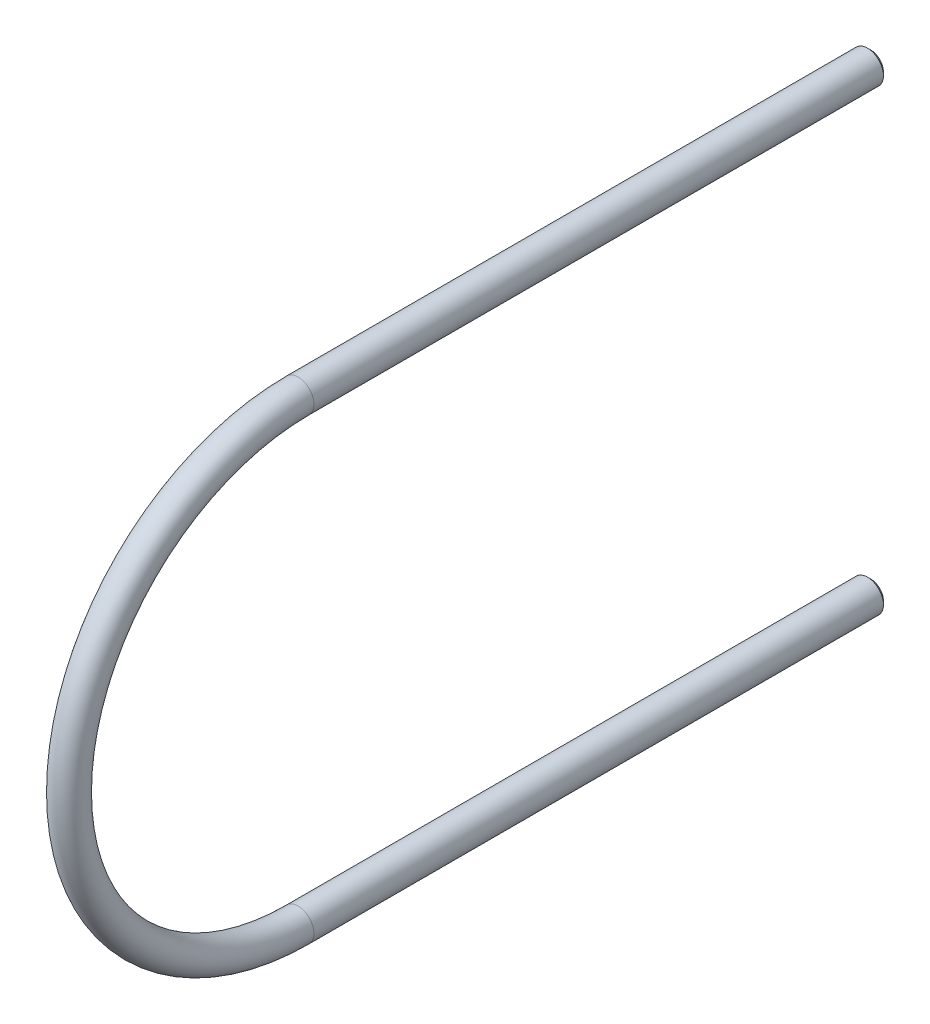
ISO-10303-21;
HEADER;
FILE_DESCRIPTION(('STEP AP214'),'2;1');
FILE_NAME('part.step','',(''),(''),'','','');
FILE_SCHEMA(('AUTOMOTIVE_DESIGN { 1 0 10303 214 1 1 1 1 }'));
ENDSEC;
DATA;
#1=APPLICATION_CONTEXT('core data for automotive mechanical design processes');
#2=APPLICATION_PROTOCOL_DEFINITION('international standard','automotive_design',2000,#1);
#3=PRODUCT_CONTEXT('',#1,'mechanical');
#4=PRODUCT('Part','Part','',(#3));
#5=PRODUCT_RELATED_PRODUCT_CATEGORY('part','',(#4));
#6=PRODUCT_DEFINITION_FORMATION('','',#4);
#7=PRODUCT_DEFINITION_CONTEXT('part definition',#1,'design');
#8=PRODUCT_DEFINITION('design','',#6,#7);
#9=PRODUCT_DEFINITION_SHAPE('','',#8);
#10=(LENGTH_UNIT() NAMED_UNIT(*) SI_UNIT(.MILLI.,.METRE.));
#11=(NAMED_UNIT(*) PLANE_ANGLE_UNIT() SI_UNIT($,.RADIAN.));
#12=(NAMED_UNIT(*) SI_UNIT($,.STERADIAN.) SOLID_ANGLE_UNIT());
#13=UNCERTAINTY_MEASURE_WITH_UNIT(LENGTH_MEASURE(1.E-05),#10,'distance_accuracy_value','');
#14=(GEOMETRIC_REPRESENTATION_CONTEXT(3) GLOBAL_UNCERTAINTY_ASSIGNED_CONTEXT((#13)) GLOBAL_UNIT_ASSIGNED_CONTEXT((#10,
#11,#12)) REPRESENTATION_CONTEXT('',''));
#15=CARTESIAN_POINT('',(0.,0.,0.));
#16=DIRECTION('',(0.,0.,1.));
#17=DIRECTION('',(1.,0.,0.));
#18=AXIS2_PLACEMENT_3D('',#15,#16,#17);
#19=CARTESIAN_POINT('',(0.,0.,0.));
#20=DIRECTION('',(-1.,0.,0.));
#21=DIRECTION('',(0.,0.,1.));
#22=AXIS2_PLACEMENT_3D('',#19,#20,#21);
#23=TOROIDAL_SURFACE('',#22,36.,2.5);
#24=CARTESIAN_POINT('',(0.,-36.,-2.51386656396706E-13));
#25=DIRECTION('',(0.,0.,-1.));
#26=DIRECTION('',(1.,0.,0.));
#27=AXIS2_PLACEMENT_3D('',#24,#25,#26);
#28=CIRCLE('',#27,2.5);
#29=CARTESIAN_POINT('',(0.,-38.5,-2.68844063090921E-13));
#30=VERTEX_POINT('',#29);
#31=EDGE_CURVE('E54',#30,#30,#28,.T.);
#32=CARTESIAN_POINT('',(0.,36.,0.));
#33=DIRECTION('',(0.,0.,1.));
#34=DIRECTION('',(1.,0.,0.));
#35=AXIS2_PLACEMENT_3D('',#32,#33,#34);
#36=CIRCLE('',#35,2.5);
#37=CARTESIAN_POINT('',(0.,38.5,0.));
#38=VERTEX_POINT('',#37);
#39=EDGE_CURVE('E57',#38,#38,#36,.T.);
#40=CARTESIAN_POINT('',(0.,0.,0.));
#41=DIRECTION('',(-1.,0.,0.));
#42=DIRECTION('',(0.,0.,1.));
#43=AXIS2_PLACEMENT_3D('',#40,#41,#42);
#44=CIRCLE('',#43,38.5);
#45=EDGE_CURVE('',#30,#38,#44,.T.);
#46=ORIENTED_EDGE('',*,*,#31,.F.);
#47=ORIENTED_EDGE('',*,*,#39,.T.);
#48=ORIENTED_EDGE('',*,*,#45,.T.);
#49=ORIENTED_EDGE('',*,*,#45,.F.);
#50=EDGE_LOOP('',(#46,#48,#47,#49));
#51=FACE_BOUND('',#50,.T.);
#52=ADVANCED_FACE('F33',(#51),#23,.T.);
#53=CARTESIAN_POINT('',(0.,36.,-90.));
#54=DIRECTION('',(0.,0.,1.));
#55=DIRECTION('',(1.,0.,0.));
#56=AXIS2_PLACEMENT_3D('',#53,#54,#55);
#57=CYLINDRICAL_SURFACE('',#56,2.5);
#58=CARTESIAN_POINT('',(0.,36.,-89.4999999999999));
#59=DIRECTION('',(0.,0.,1.));
#60=DIRECTION('',(1.,0.,0.));
#61=AXIS2_PLACEMENT_3D('',#58,#59,#60);
#62=CIRCLE('',#61,2.5);
#63=CARTESIAN_POINT('',(2.5,36.,-89.4999999999999));
#64=VERTEX_POINT('',#63);
#65=EDGE_CURVE('E41',#64,#64,#62,.T.);
#66=ORIENTED_EDGE('',*,*,#65,.T.);
#67=EDGE_LOOP('',(#66));
#68=FACE_BOUND('',#67,.T.);
#69=ORIENTED_EDGE('',*,*,#39,.F.);
#70=EDGE_LOOP('',(#69));
#71=FACE_BOUND('',#70,.T.);
#72=ADVANCED_FACE('F62',(#68,#71),#57,.T.);
#73=CARTESIAN_POINT('',(0.,36.,-90.));
#74=DIRECTION('',(0.,0.,1.));
#75=DIRECTION('',(1.,0.,0.));
#76=AXIS2_PLACEMENT_3D('',#73,#74,#75);
#77=PLANE('',#76);
#78=CARTESIAN_POINT('',(0.,36.,-90.));
#79=DIRECTION('',(0.,0.,1.));
#80=DIRECTION('',(1.,0.,0.));
#81=AXIS2_PLACEMENT_3D('',#78,#79,#80);
#82=CIRCLE('',#81,1.99999999999992);
#83=CARTESIAN_POINT('',(1.99999999999992,36.,-90.));
#84=VERTEX_POINT('',#83);
#85=EDGE_CURVE('E10',#84,#84,#82,.F.);
#86=ORIENTED_EDGE('',*,*,#85,.T.);
#87=EDGE_LOOP('',(#86));
#88=FACE_BOUND('',#87,.T.);
#89=ADVANCED_FACE('F64',(#88),#77,.F.);
#90=CARTESIAN_POINT('',(0.,-35.9999999999994,-90.0000000000002));
#91=DIRECTION('',(0.,0.,1.));
#92=DIRECTION('',(0.,-1.,0.));
#93=AXIS2_PLACEMENT_3D('',#90,#91,#92);
#94=CYLINDRICAL_SURFACE('',#93,2.5);
#95=CARTESIAN_POINT('',(0.,-35.9999999999994,-89.5000000000003));
#96=DIRECTION('',(0.,0.,-1.));
#97=DIRECTION('',(0.,1.,0.));
#98=AXIS2_PLACEMENT_3D('',#95,#96,#97);
#99=CIRCLE('',#98,2.5);
#100=CARTESIAN_POINT('',(0.,-33.4999999999994,-89.5000000000002));
#101=VERTEX_POINT('',#100);
#102=EDGE_CURVE('E45',#101,#101,#99,.F.);
#103=ORIENTED_EDGE('',*,*,#102,.T.);
#104=EDGE_LOOP('',(#103));
#105=FACE_BOUND('',#104,.T.);
#106=ORIENTED_EDGE('',*,*,#31,.T.);
#107=EDGE_LOOP('',(#106));
#108=FACE_BOUND('',#107,.T.);
#109=ADVANCED_FACE('F70',(#105,#108),#94,.T.);
#110=CARTESIAN_POINT('',(0.,-35.9999999999994,-90.0000000000002));
#111=DIRECTION('',(0.,0.,-1.));
#112=DIRECTION('',(0.,1.,0.));
#113=AXIS2_PLACEMENT_3D('',#110,#111,#112);
#114=PLANE('',#113);
#115=CARTESIAN_POINT('',(0.,-35.9999999999994,-90.0000000000002));
#116=DIRECTION('',(0.,0.,-1.));
#117=DIRECTION('',(0.,1.,0.));
#118=AXIS2_PLACEMENT_3D('',#115,#116,#117);
#119=CIRCLE('',#118,2.00000000000002);
#120=CARTESIAN_POINT('',(0.,-33.9999999999993,-90.0000000000002));
#121=VERTEX_POINT('',#120);
#122=EDGE_CURVE('E49',#121,#121,#119,.T.);
#123=ORIENTED_EDGE('',*,*,#122,.T.);
#124=EDGE_LOOP('',(#123));
#125=FACE_BOUND('',#124,.T.);
#126=ADVANCED_FACE('F80',(#125),#114,.T.);
#127=CARTESIAN_POINT('',(0.,-35.9999999999994,-90.0000000000002));
#128=DIRECTION('',(0.,0.,1.));
#129=DIRECTION('',(0.,-1.,0.));
#130=AXIS2_PLACEMENT_3D('',#127,#128,#129);
#131=CONICAL_SURFACE('',#130,2.00000000000004,0.78539816339744);
#132=ORIENTED_EDGE('',*,*,#102,.F.);
#133=EDGE_LOOP('',(#132));
#134=FACE_BOUND('',#133,.T.);
#135=ORIENTED_EDGE('',*,*,#122,.F.);
#136=EDGE_LOOP('',(#135));
#137=FACE_BOUND('',#136,.T.);
#138=ADVANCED_FACE('F76',(#134,#137),#131,.T.);
#139=CARTESIAN_POINT('',(0.,36.,-89.4999999999999));
#140=DIRECTION('',(0.,0.,1.));
#141=DIRECTION('',(1.,0.,0.));
#142=AXIS2_PLACEMENT_3D('',#139,#140,#141);
#143=CONICAL_SURFACE('',#142,2.5,0.785398163397461);
#144=ORIENTED_EDGE('',*,*,#85,.F.);
#145=EDGE_LOOP('',(#144));
#146=FACE_BOUND('',#145,.T.);
#147=ORIENTED_EDGE('',*,*,#65,.F.);
#148=EDGE_LOOP('',(#147));
#149=FACE_BOUND('',#148,.T.);
#150=ADVANCED_FACE('F36',(#146,#149),#143,.T.);
#151=CLOSED_SHELL('',(#52,#72,#89,#109,#126,#138,#150));
#152=MANIFOLD_SOLID_BREP('B2',#151);
#153=ADVANCED_BREP_SHAPE_REPRESENTATION('',(#18,#152),#14);
#154=SHAPE_DEFINITION_REPRESENTATION(#9,#153);
ENDSEC;
END-ISO-10303-21;
